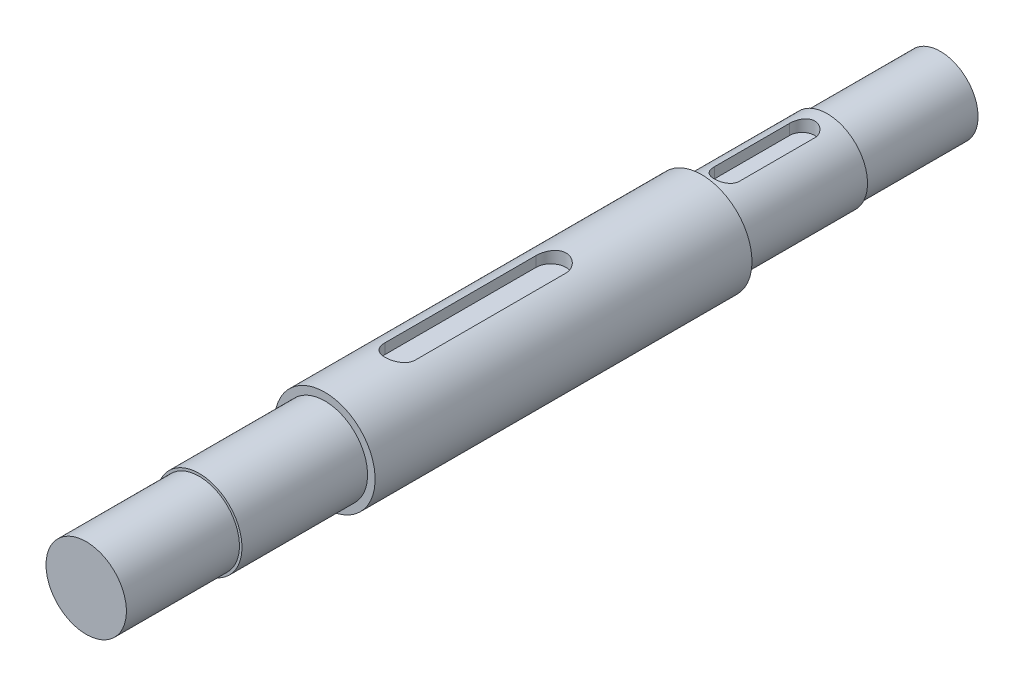
ISO-10303-21;
HEADER;
FILE_DESCRIPTION(('STEP AP214'),'2;1');
FILE_NAME('part.step','',(''),(''),'','','');
FILE_SCHEMA(('AUTOMOTIVE_DESIGN { 1 0 10303 214 1 1 1 1 }'));
ENDSEC;
DATA;
#1=APPLICATION_CONTEXT('core data for automotive mechanical design processes');
#2=APPLICATION_PROTOCOL_DEFINITION('international standard','automotive_design',2000,#1);
#3=PRODUCT_CONTEXT('',#1,'mechanical');
#4=PRODUCT('Part','Part','',(#3));
#5=PRODUCT_RELATED_PRODUCT_CATEGORY('part','',(#4));
#6=PRODUCT_DEFINITION_FORMATION('','',#4);
#7=PRODUCT_DEFINITION_CONTEXT('part definition',#1,'design');
#8=PRODUCT_DEFINITION('design','',#6,#7);
#9=PRODUCT_DEFINITION_SHAPE('','',#8);
#10=(LENGTH_UNIT() NAMED_UNIT(*) SI_UNIT(.MILLI.,.METRE.));
#11=(NAMED_UNIT(*) PLANE_ANGLE_UNIT() SI_UNIT($,.RADIAN.));
#12=(NAMED_UNIT(*) SI_UNIT($,.STERADIAN.) SOLID_ANGLE_UNIT());
#13=UNCERTAINTY_MEASURE_WITH_UNIT(LENGTH_MEASURE(1.E-05),#10,'distance_accuracy_value','');
#14=(GEOMETRIC_REPRESENTATION_CONTEXT(3) GLOBAL_UNCERTAINTY_ASSIGNED_CONTEXT((#13)) GLOBAL_UNIT_ASSIGNED_CONTEXT((#10,
#11,#12)) REPRESENTATION_CONTEXT('',''));
#15=CARTESIAN_POINT('',(0.,0.,0.));
#16=DIRECTION('',(0.,0.,1.));
#17=DIRECTION('',(1.,0.,0.));
#18=AXIS2_PLACEMENT_3D('',#15,#16,#17);
#19=CARTESIAN_POINT('',(0.,0.,0.));
#20=DIRECTION('',(0.,0.,-1.));
#21=DIRECTION('',(-1.,0.,0.));
#22=AXIS2_PLACEMENT_3D('',#19,#20,#21);
#23=CYLINDRICAL_SURFACE('',#22,20.);
#24=CARTESIAN_POINT('',(0.,0.,95.));
#25=DIRECTION('',(0.,0.,-1.));
#26=DIRECTION('',(-1.,0.,0.));
#27=AXIS2_PLACEMENT_3D('',#24,#25,#26);
#28=CIRCLE('',#27,20.);
#29=CARTESIAN_POINT('',(-20.,0.,95.));
#30=VERTEX_POINT('',#29);
#31=EDGE_CURVE('E184',#30,#30,#28,.T.);
#32=ORIENTED_EDGE('',*,*,#31,.F.);
#33=EDGE_LOOP('',(#32));
#34=FACE_BOUND('',#33,.T.);
#35=CARTESIAN_POINT('',(0.,0.,245.));
#36=DIRECTION('',(0.,0.,-1.));
#37=DIRECTION('',(-1.,0.,0.));
#38=AXIS2_PLACEMENT_3D('',#35,#36,#37);
#39=CIRCLE('',#38,20.);
#40=CARTESIAN_POINT('',(-20.,0.,245.));
#41=VERTEX_POINT('',#40);
#42=EDGE_CURVE('E188',#41,#41,#39,.T.);
#43=ORIENTED_EDGE('',*,*,#42,.T.);
#44=EDGE_LOOP('',(#43));
#45=FACE_BOUND('',#44,.T.);
#46=CARTESIAN_POINT('',(6.00000000000017,19.0787840283389,155.));
#47=CARTESIAN_POINT('',(6.00002230630971,19.0787603919218,154.835332005089));
#48=CARTESIAN_POINT('',(5.99322212828878,19.0809150948053,154.67067261307));
#49=CARTESIAN_POINT('',(5.96614198358455,19.089408588524,154.342610571615));
#50=CARTESIAN_POINT('',(5.94586504749999,19.0957464386677,154.179207647986));
#51=CARTESIAN_POINT('',(5.89206455668675,19.1124126760414,153.855233206316));
#52=CARTESIAN_POINT('',(5.85857463708954,19.1227309292375,153.694655572036));
#53=CARTESIAN_POINT('',(5.77865096251394,19.1470349488515,153.377037691332));
#54=CARTESIAN_POINT('',(5.73221686903448,19.16102081118,153.219997537531));
#55=CARTESIAN_POINT('',(5.62682620459501,19.1922338155173,152.910617439276));
#56=CARTESIAN_POINT('',(5.5678770245257,19.2094590438082,152.758274781224));
#57=CARTESIAN_POINT('',(5.43788252899642,19.2466621419291,152.459125857098));
#58=CARTESIAN_POINT('',(5.36683271334074,19.2666410353108,152.312321675672));
#59=CARTESIAN_POINT('',(5.21317247195212,19.3087849542851,152.025215054747));
#60=CARTESIAN_POINT('',(5.1305613960985,19.3309501027959,151.88491298147));
#61=CARTESIAN_POINT('',(4.95431913401991,19.3768680311909,151.611612201325));
#62=CARTESIAN_POINT('',(4.86068378223789,19.4006214097184,151.478616283128));
#63=CARTESIAN_POINT('',(4.66024014290241,19.4497584548899,151.21713642677));
#64=CARTESIAN_POINT('',(4.55313526362707,19.4751691904068,151.088884847802));
#65=CARTESIAN_POINT('',(4.32860344600283,19.5263015189751,150.841746062991));
#66=CARTESIAN_POINT('',(4.21117292654735,19.5520232171847,150.722862133329));
#67=CARTESIAN_POINT('',(3.96676059198608,19.6030710031715,150.495258604878));
#68=CARTESIAN_POINT('',(3.83977871873954,19.6283970885393,150.386539067971));
#69=CARTESIAN_POINT('',(3.57705696576226,19.6779706962222,150.179980745528));
#70=CARTESIAN_POINT('',(3.44131715512985,19.7022182270443,150.082141874161));
#71=CARTESIAN_POINT('',(3.15899953964094,19.7494715734221,149.89609023174));
#72=CARTESIAN_POINT('',(3.01225429870671,19.7724407517412,149.808121953698));
#73=CARTESIAN_POINT('',(2.71155717798069,19.8159158974823,149.644936205945));
#74=CARTESIAN_POINT('',(2.55760798995113,19.8364227748921,149.569714021433));
#75=CARTESIAN_POINT('',(2.24348996032498,19.8744001644265,149.432583560629));
#76=CARTESIAN_POINT('',(2.08331997555635,19.8918701152059,149.370677745232));
#77=CARTESIAN_POINT('',(1.75801430484789,19.923254535561,149.260762497544));
#78=CARTESIAN_POINT('',(1.59288079897405,19.9371705413066,149.212747060032));
#79=CARTESIAN_POINT('',(1.26354510595591,19.960709769643,149.132174453272));
#80=CARTESIAN_POINT('',(1.09944808925095,19.9704430293701,149.099219373042));
#81=CARTESIAN_POINT('',(0.768952154149116,19.9858966495547,149.047128002714));
#82=CARTESIAN_POINT('',(0.602554181799461,19.9916186120195,149.027986195865));
#83=CARTESIAN_POINT('',(0.268644299740396,19.9988929276978,149.003680035143));
#84=CARTESIAN_POINT('',(0.101132356361144,20.0004451543013,148.998516105694));
#85=CARTESIAN_POINT('',(-0.23372090041069,19.9993350985709,149.002216405078));
#86=CARTESIAN_POINT('',(-0.401062216878332,19.9966728935832,149.011080376463));
#87=CARTESIAN_POINT('',(-0.728949940400138,19.9873626800315,149.042242211602));
#88=CARTESIAN_POINT('',(-0.889542117296485,19.9808452710305,149.064100009983));
#89=CARTESIAN_POINT('',(-1.20830021014889,19.9641050678088,149.120695481758));
#90=CARTESIAN_POINT('',(-1.36646528055398,19.9538810115069,149.155437542225));
#91=CARTESIAN_POINT('',(-1.67917461818921,19.9300014175933,149.23749230161));
#92=CARTESIAN_POINT('',(-1.83372008335715,19.916347033335,149.284800775723));
#93=CARTESIAN_POINT('',(-2.13828018933718,19.8859545815151,149.391630271063));
#94=CARTESIAN_POINT('',(-2.28829310223854,19.8692153547843,149.451155883997));
#95=CARTESIAN_POINT('',(-2.58443507880925,19.8328818557961,149.582690579539));
#96=CARTESIAN_POINT('',(-2.73050124822103,19.8132575095083,149.654832897198));
#97=CARTESIAN_POINT('',(-3.01609632375403,19.7717979578185,149.810623147329));
#98=CARTESIAN_POINT('',(-3.15562296424223,19.7499619943592,149.894275028384));
#99=CARTESIAN_POINT('',(-3.42724384686874,19.704643118031,150.072486982441));
#100=CARTESIAN_POINT('',(-3.55933800314009,19.681160186142,150.167047181428));
#101=CARTESIAN_POINT('',(-3.81531376455338,19.6331439703208,150.366458678429));
#102=CARTESIAN_POINT('',(-3.93919513006467,19.6086106557752,150.471310276501));
#103=CARTESIAN_POINT('',(-4.18263653591635,19.5581593507452,150.694897243463));
#104=CARTESIAN_POINT('',(-4.30184428600917,19.5322244988475,150.814012679474));
#105=CARTESIAN_POINT('',(-4.52981041510251,19.4806179410543,151.061833503502));
#106=CARTESIAN_POINT('',(-4.63857214120799,19.4549461532391,151.190535796081));
#107=CARTESIAN_POINT('',(-4.84504126060948,19.4045581786368,151.456840396238));
#108=CARTESIAN_POINT('',(-4.94274124635215,19.3798426394128,151.594448571901));
#109=CARTESIAN_POINT('',(-5.12628631686307,19.3321023379675,151.877559092333));
#110=CARTESIAN_POINT('',(-5.21213600998861,19.3090769201298,152.023058337578));
#111=CARTESIAN_POINT('',(-5.3722308036755,19.2651525602886,152.322635135093));
#112=CARTESIAN_POINT('',(-5.44634371437385,19.2442786555292,152.476787078659));
#113=CARTESIAN_POINT('',(-5.58122691640486,19.205593723789,152.791121841361));
#114=CARTESIAN_POINT('',(-5.64200266456187,19.1877814448102,152.951302162478));
#115=CARTESIAN_POINT('',(-5.74966145349615,19.1557967477957,153.27643211835));
#116=CARTESIAN_POINT('',(-5.7965591282547,19.1416204978024,153.441376526563));
#117=CARTESIAN_POINT('',(-5.87609462586421,19.1173543231183,153.774893180451));
#118=CARTESIAN_POINT('',(-5.9087390260436,19.1072625137755,153.943463715048));
#119=CARTESIAN_POINT('',(-5.95603131732384,19.0925703406669,154.259937070236));
#120=CARTESIAN_POINT('',(-5.97251971262409,19.0874107715083,154.40754170936));
#121=CARTESIAN_POINT('',(-5.99450261914139,19.0805126306353,154.703427112475));
#122=CARTESIAN_POINT('',(-6.00001329545491,19.0787690288454,154.851706559575));
#123=CARTESIAN_POINT('',(-5.99999999999983,19.078784028339,155.));
#124=B_SPLINE_CURVE_WITH_KNOTS('',3,(#46,#47,#48,#49,#50,#51,#52,#53,#54,#55,#56,#57,#58,#59,
#60,#61,#62,#63,#64,#65,#66,#67,#68,#69,#70,#71,#72,#73,#74,#75,#76,#77,#78,#79,#80,#81,#82,#83,
#84,#85,#86,#87,#88,#89,#90,#91,#92,#93,#94,#95,#96,#97,#98,#99,#100,#101,#102,#103,#104,#105,
#106,#107,#108,#109,#110,#111,#112,#113,#114,#115,#116,#117,#118,#119,#120,#121,#122,#123),
.UNSPECIFIED.,.F.,.F.,(4,2,2,2,2,2,2,2,2,2,2,2,2,2,2,2,2,2,2,2,2,2,2,2,2,2,2,2,2,2,2,2,2,2,2,2,
2,2,4),(0.,0.493836284878976,0.987561555412216,1.48003801924605,1.97252736296405,
2.46472666795178,2.95710942192586,3.44951987503682,3.94211698773,4.44857898474592,
4.95521732942468,5.46185875834847,5.96849619046396,6.48574341264193,7.00279888450885,
7.51994982748061,8.03687685551445,8.53921958328379,9.04136157401789,9.5435188116382,
10.0456668334346,10.531706521874,11.0179118582603,11.5039539397552,11.9901790315928,
12.4818885441265,12.9737671698834,13.4656514771114,13.9575501300996,14.4684682486943,
14.9792221093922,15.4903160010787,16.001210574562,16.5175029344931,17.0335836608614,
17.549118241575,18.0644146711719,18.509813123396,18.9545552237083),.UNSPECIFIED.);
#125=CARTESIAN_POINT('',(6.00000000000017,19.0787840283389,155.));
#126=VERTEX_POINT('',#125);
#127=CARTESIAN_POINT('',(-5.99999999999983,19.078784028339,155.));
#128=VERTEX_POINT('',#127);
#129=EDGE_CURVE('E251',#126,#128,#124,.T.);
#130=ORIENTED_EDGE('',*,*,#129,.F.);
#131=DIRECTION('',(0.,0.,-1.));
#132=VECTOR('',#131,1.);
#133=CARTESIAN_POINT('',(6.00000000000017,19.0787840283389,0.));
#134=LINE('',#133,#132);
#135=CARTESIAN_POINT('',(6.00000000000017,19.0787840283389,215.));
#136=VERTEX_POINT('',#135);
#137=EDGE_CURVE('E11',#136,#126,#134,.T.);
#138=ORIENTED_EDGE('',*,*,#137,.F.);
#139=CARTESIAN_POINT('',(-5.99999999999983,19.078784028339,215.));
#140=CARTESIAN_POINT('',(-6.00002230630936,19.0787603919219,215.164667994911));
#141=CARTESIAN_POINT('',(-5.99322212828844,19.0809150948054,215.32932738693));
#142=CARTESIAN_POINT('',(-5.96614198358421,19.0894085885241,215.657389428385));
#143=CARTESIAN_POINT('',(-5.94586504749965,19.0957464386678,215.820792352014));
#144=CARTESIAN_POINT('',(-5.89206455668642,19.1124126760415,216.144766793684));
#145=CARTESIAN_POINT('',(-5.8585746370892,19.1227309292376,216.305344427964));
#146=CARTESIAN_POINT('',(-5.7786509625136,19.1470349488516,216.622962308668));
#147=CARTESIAN_POINT('',(-5.73221686903414,19.1610208111801,216.780002462469));
#148=CARTESIAN_POINT('',(-5.62682620459467,19.1922338155173,217.089382560724));
#149=CARTESIAN_POINT('',(-5.56787702452536,19.2094590438083,217.241725218776));
#150=CARTESIAN_POINT('',(-5.43788252899608,19.2466621419291,217.540874142902));
#151=CARTESIAN_POINT('',(-5.36683271334041,19.2666410353109,217.687678324328));
#152=CARTESIAN_POINT('',(-5.21317247195179,19.3087849542852,217.974784945253));
#153=CARTESIAN_POINT('',(-5.13056139609817,19.330950102796,218.11508701853));
#154=CARTESIAN_POINT('',(-4.95431913401957,19.3768680311909,218.388387798675));
#155=CARTESIAN_POINT('',(-4.86068378223755,19.4006214097185,218.521383716872));
#156=CARTESIAN_POINT('',(-4.66024014290207,19.44975845489,218.78286357323));
#157=CARTESIAN_POINT('',(-4.55313526362673,19.4751691904069,218.911115152198));
#158=CARTESIAN_POINT('',(-4.32860344600248,19.5263015189752,219.158253937009));
#159=CARTESIAN_POINT('',(-4.21117292654701,19.5520232171848,219.277137866671));
#160=CARTESIAN_POINT('',(-3.96676059198573,19.6030710031715,219.504741395122));
#161=CARTESIAN_POINT('',(-3.83977871873919,19.6283970885394,219.613460932029));
#162=CARTESIAN_POINT('',(-3.57705696576191,19.6779706962223,219.820019254472));
#163=CARTESIAN_POINT('',(-3.44131715512949,19.7022182270444,219.917858125839));
#164=CARTESIAN_POINT('',(-3.15899953964057,19.7494715734221,220.10390976826));
#165=CARTESIAN_POINT('',(-3.01225429870634,19.7724407517413,220.191878046302));
#166=CARTESIAN_POINT('',(-2.71155717798033,19.8159158974823,220.355063794055));
#167=CARTESIAN_POINT('',(-2.55760798995078,19.8364227748921,220.430285978567));
#168=CARTESIAN_POINT('',(-2.24348996032463,19.8744001644266,220.567416439371));
#169=CARTESIAN_POINT('',(-2.083319975556,19.8918701152059,220.629322254768));
#170=CARTESIAN_POINT('',(-1.75801430484754,19.9232545355611,220.739237502456));
#171=CARTESIAN_POINT('',(-1.59288079897371,19.9371705413066,220.787252939968));
#172=CARTESIAN_POINT('',(-1.26354510595557,19.960709769643,220.867825546728));
#173=CARTESIAN_POINT('',(-1.09944808925061,19.9704430293702,220.900780626958));
#174=CARTESIAN_POINT('',(-0.76895215414877,19.9858966495547,220.952871997286));
#175=CARTESIAN_POINT('',(-0.602554181799117,19.9916186120196,220.972013804135));
#176=CARTESIAN_POINT('',(-0.268644299740054,19.9988929276978,220.996319964857));
#177=CARTESIAN_POINT('',(-0.1011323563608,20.0004451543013,221.001483894306));
#178=CARTESIAN_POINT('',(0.233720900411035,19.9993350985709,220.997783594922));
#179=CARTESIAN_POINT('',(0.401062216878677,19.9966728935831,220.988919623537));
#180=CARTESIAN_POINT('',(0.72894994040048,19.9873626800315,220.957757788398));
#181=CARTESIAN_POINT('',(0.889542117296824,19.9808452710305,220.935899990017));
#182=CARTESIAN_POINT('',(1.20830021014923,19.9641050678088,220.879304518242));
#183=CARTESIAN_POINT('',(1.36646528055431,19.9538810115069,220.844562457775));
#184=CARTESIAN_POINT('',(1.67917461818955,19.9300014175933,220.76250769839));
#185=CARTESIAN_POINT('',(1.83372008335749,19.916347033335,220.715199224277));
#186=CARTESIAN_POINT('',(2.13828018933751,19.885954581515,220.608369728937));
#187=CARTESIAN_POINT('',(2.28829310223887,19.8692153547843,220.548844116003));
#188=CARTESIAN_POINT('',(2.58443507880958,19.8328818557961,220.417309420461));
#189=CARTESIAN_POINT('',(2.73050124822137,19.8132575095082,220.345167102802));
#190=CARTESIAN_POINT('',(3.01609632375437,19.7717979578185,220.189376852671));
#191=CARTESIAN_POINT('',(3.15562296424257,19.7499619943591,220.105724971616));
#192=CARTESIAN_POINT('',(3.42724384686907,19.704643118031,219.927513017559));
#193=CARTESIAN_POINT('',(3.55933800314043,19.6811601861419,219.832952818572));
#194=CARTESIAN_POINT('',(3.81531376455373,19.6331439703208,219.633541321571));
#195=CARTESIAN_POINT('',(3.93919513006501,19.6086106557752,219.528689723499));
#196=CARTESIAN_POINT('',(4.18263653591669,19.5581593507451,219.305102756537));
#197=CARTESIAN_POINT('',(4.30184428600951,19.5322244988474,219.185987320526));
#198=CARTESIAN_POINT('',(4.52981041510285,19.4806179410542,218.938166496498));
#199=CARTESIAN_POINT('',(4.63857214120832,19.454946153239,218.809464203919));
#200=CARTESIAN_POINT('',(4.84504126060982,19.4045581786367,218.543159603762));
#201=CARTESIAN_POINT('',(4.94274124635249,19.3798426394128,218.405551428099));
#202=CARTESIAN_POINT('',(5.12628631686341,19.3321023379674,218.122440907667));
#203=CARTESIAN_POINT('',(5.21213600998894,19.3090769201297,217.976941662422));
#204=CARTESIAN_POINT('',(5.37223080367583,19.2651525602885,217.677364864907));
#205=CARTESIAN_POINT('',(5.44634371437418,19.2442786555291,217.523212921341));
#206=CARTESIAN_POINT('',(5.58122691640519,19.2055937237889,217.208878158639));
#207=CARTESIAN_POINT('',(5.6420026645622,19.1877814448102,217.048697837522));
#208=CARTESIAN_POINT('',(5.74966145349648,19.1557967477956,216.72356788165));
#209=CARTESIAN_POINT('',(5.79655912825504,19.1416204978023,216.558623473437));
#210=CARTESIAN_POINT('',(5.87609462586455,19.1173543231182,216.225106819549));
#211=CARTESIAN_POINT('',(5.90873902604394,19.1072625137754,216.056536284952));
#212=CARTESIAN_POINT('',(5.95603131732418,19.0925703406668,215.740062929764));
#213=CARTESIAN_POINT('',(5.97251971262442,19.0874107715082,215.59245829064));
#214=CARTESIAN_POINT('',(5.99450261914172,19.0805126306352,215.296572887525));
#215=CARTESIAN_POINT('',(6.00001329545525,19.0787690288453,215.148293440425));
#216=CARTESIAN_POINT('',(6.00000000000017,19.0787840283389,215.));
#217=B_SPLINE_CURVE_WITH_KNOTS('',3,(#139,#140,#141,#142,#143,#144,#145,#146,#147,#148,#149,
#150,#151,#152,#153,#154,#155,#156,#157,#158,#159,#160,#161,#162,#163,#164,#165,#166,#167,#168,
#169,#170,#171,#172,#173,#174,#175,#176,#177,#178,#179,#180,#181,#182,#183,#184,#185,#186,#187,
#188,#189,#190,#191,#192,#193,#194,#195,#196,#197,#198,#199,#200,#201,#202,#203,#204,#205,#206,
#207,#208,#209,#210,#211,#212,#213,#214,#215,#216),.UNSPECIFIED.,.F.,.F.,(4,2,2,2,2,2,2,2,2,2,2,
2,2,2,2,2,2,2,2,2,2,2,2,2,2,2,2,2,2,2,2,2,2,2,2,2,2,2,4),(0.,0.493836284878976,
0.987561555412215,1.48003801924605,1.97252736296405,2.46472666795178,2.95710942192586,
3.44951987503682,3.94211698772999,4.44857898474592,4.95521732942468,5.46185875834849,
5.96849619046399,6.48574341264197,7.00279888450886,7.51994982748061,8.03687685551445,
8.5392195832838,9.0413615740179,9.54351881163821,10.0456668334346,10.531706521874,
11.0179118582603,11.5039539397551,11.9901790315928,12.4818885441265,12.9737671698834,
13.4656514771114,13.9575501300996,14.4684682486943,14.9792221093922,15.4903160010787,
16.001210574562,16.517502934493,17.0335836608614,17.5491182415751,18.0644146711719,
18.509813123396,18.9545552237083),.UNSPECIFIED.);
#218=CARTESIAN_POINT('',(-5.99999999999983,19.078784028339,215.));
#219=VERTEX_POINT('',#218);
#220=EDGE_CURVE('E52',#219,#136,#217,.T.);
#221=ORIENTED_EDGE('',*,*,#220,.F.);
#222=DIRECTION('',(0.,0.,-1.));
#223=VECTOR('',#222,1.);
#224=CARTESIAN_POINT('',(-5.99999999999983,19.078784028339,0.));
#225=LINE('',#224,#223);
#226=EDGE_CURVE('E131',#128,#219,#225,.F.);
#227=ORIENTED_EDGE('',*,*,#226,.F.);
#228=EDGE_LOOP('',(#130,#138,#221,#227));
#229=FACE_BOUND('',#228,.T.);
#230=ADVANCED_FACE('F43',(#34,#45,#229),#23,.T.);
#231=CARTESIAN_POINT('',(0.,0.,0.));
#232=DIRECTION('',(0.,0.,-1.));
#233=DIRECTION('',(-1.,0.,0.));
#234=AXIS2_PLACEMENT_3D('',#231,#232,#233);
#235=CYLINDRICAL_SURFACE('',#234,16.);
#236=CARTESIAN_POINT('',(0.,0.,45.));
#237=DIRECTION('',(0.,0.,-1.));
#238=DIRECTION('',(-1.,0.,0.));
#239=AXIS2_PLACEMENT_3D('',#236,#237,#238);
#240=CIRCLE('',#239,16.);
#241=CARTESIAN_POINT('',(-16.,0.,45.));
#242=VERTEX_POINT('',#241);
#243=EDGE_CURVE('E176',#242,#242,#240,.T.);
#244=ORIENTED_EDGE('',*,*,#243,.F.);
#245=EDGE_LOOP('',(#244));
#246=FACE_BOUND('',#245,.T.);
#247=CARTESIAN_POINT('',(0.,0.,95.));
#248=DIRECTION('',(0.,0.,-1.));
#249=DIRECTION('',(-1.,0.,0.));
#250=AXIS2_PLACEMENT_3D('',#247,#248,#249);
#251=CIRCLE('',#250,16.);
#252=CARTESIAN_POINT('',(-16.,0.,95.));
#253=VERTEX_POINT('',#252);
#254=EDGE_CURVE('E180',#253,#253,#251,.T.);
#255=ORIENTED_EDGE('',*,*,#254,.T.);
#256=EDGE_LOOP('',(#255));
#257=FACE_BOUND('',#256,.T.);
#258=CARTESIAN_POINT('',(-4.99999999999999,15.1986841535707,85.));
#259=CARTESIAN_POINT('',(-5.00001876402017,15.1986635060155,85.1369297177379));
#260=CARTESIAN_POINT('',(-4.99437589347759,15.2005339376472,85.2738515786107));
#261=CARTESIAN_POINT('',(-4.9719066012981,15.2079058985265,85.5466441616811));
#262=CARTESIAN_POINT('',(-4.95508287500205,15.2134065526432,85.682515129231));
#263=CARTESIAN_POINT('',(-4.91045141983463,15.2278686056186,85.9518756253299));
#264=CARTESIAN_POINT('',(-4.88267328245064,15.2368206796073,86.0853705652593));
#265=CARTESIAN_POINT('',(-4.81639022533697,15.2579029145887,86.3494121913658));
#266=CARTESIAN_POINT('',(-4.77788498675235,15.2700331700498,86.479958789781));
#267=CARTESIAN_POINT('',(-4.6904983772981,15.2971014107057,86.7371387356005));
#268=CARTESIAN_POINT('',(-4.64162394412444,15.3120375178334,86.8637746349516));
#269=CARTESIAN_POINT('',(-4.53387888598119,15.3442856115609,87.1124230254503));
#270=CARTESIAN_POINT('',(-4.47500453795588,15.3615984825888,87.2344337738435));
#271=CARTESIAN_POINT('',(-4.28398711580931,15.4163884767029,87.5923890679799));
#272=CARTESIAN_POINT('',(-4.13740351463561,15.4567319869187,87.8203916857904));
#273=CARTESIAN_POINT('',(-3.80477014396878,15.5420083062615,88.2559520827829));
#274=CARTESIAN_POINT('',(-3.61763914961477,15.5870445200358,88.4626585082762));
#275=CARTESIAN_POINT('',(-3.21145982301366,15.6757673694125,88.8423676526894));
#276=CARTESIAN_POINT('',(-2.99240601054463,15.7194537717275,89.0153645727234));
#277=CARTESIAN_POINT('',(-2.52249761762138,15.8017432610087,89.3264503978222));
#278=CARTESIAN_POINT('',(-2.27103576512447,15.8402090039263,89.4636611267965));
#279=CARTESIAN_POINT('',(-1.74720631304674,15.9065031203034,89.6935071381779));
#280=CARTESIAN_POINT('',(-1.47484448775401,15.9343344192537,89.7861546815474));
#281=CARTESIAN_POINT('',(-0.925860089211036,15.9754868433124,89.921404023007));
#282=CARTESIAN_POINT('',(-0.649628435012763,15.989229278753,89.9654621090382));
#283=CARTESIAN_POINT('',(-0.0933690149137086,16.0021438524195,90.0068974314688));
#284=CARTESIAN_POINT('',(0.186657953048535,16.0013190072522,90.0042843325814));
#285=CARTESIAN_POINT('',(0.73229958954639,15.9854845726588,89.9534065239998));
#286=CARTESIAN_POINT('',(0.998078033880914,15.9709657627342,89.9067212697878));
#287=CARTESIAN_POINT('',(1.51781473163232,15.9299791073477,89.7716196828297));
#288=CARTESIAN_POINT('',(1.77177234876053,15.90351061948,89.6832011065194));
#289=CARTESIAN_POINT('',(2.26431537219272,15.8409378140145,89.4661161738423));
#290=CARTESIAN_POINT('',(2.50267435181536,15.8047194262738,89.3369700371082));
#291=CARTESIAN_POINT('',(2.95480608942299,15.7264700104951,89.0425232216915));
#292=CARTESIAN_POINT('',(3.16857286940456,15.6844375745929,88.8772137804566));
#293=CARTESIAN_POINT('',(3.57495597883695,15.5969449434458,88.5068863322796));
#294=CARTESIAN_POINT('',(3.76632311133059,15.5514148920094,88.3005029256288));
#295=CARTESIAN_POINT('',(4.02553989626261,15.4855747041344,87.9689743734189));
#296=CARTESIAN_POINT('',(4.10735324144972,15.464023127535,87.8547196773283));
#297=CARTESIAN_POINT('',(4.2611738972957,15.4223452821405,87.6195614218215));
#298=CARTESIAN_POINT('',(4.33318503733556,15.4022184582275,87.4986604849243));
#299=CARTESIAN_POINT('',(4.4676837074109,15.3637482945825,87.2494667746369));
#300=CARTESIAN_POINT('',(4.53004475183007,15.3454296242414,87.1211019815447));
#301=CARTESIAN_POINT('',(4.64365087484839,15.3114343470153,86.8592633981691));
#302=CARTESIAN_POINT('',(4.69490052987993,15.2957566529907,86.7257917379939));
#303=CARTESIAN_POINT('',(4.78581076137362,15.2675565411669,86.4547920818445));
#304=CARTESIAN_POINT('',(4.82548366541209,15.2550307689955,86.3172685736427));
#305=CARTESIAN_POINT('',(4.89292357731496,15.2335336556112,86.039118633416));
#306=CARTESIAN_POINT('',(4.92069605575215,15.2245606813372,85.8984936584496));
#307=CARTESIAN_POINT('',(4.96155201839677,15.2112927618778,85.6316869336986));
#308=CARTESIAN_POINT('',(4.97596872830392,15.2065749583153,85.5057286808262));
#309=CARTESIAN_POINT('',(4.9951923004764,15.2002655216957,85.2531834848566));
#310=CARTESIAN_POINT('',(5.00001273345968,15.1986694740171,85.1265976837225));
#311=CARTESIAN_POINT('',(5.00000000000001,15.1986841535707,85.));
#312=B_SPLINE_CURVE_WITH_KNOTS('',3,(#258,#259,#260,#261,#262,#263,#264,#265,#266,#267,#268,
#269,#270,#271,#272,#273,#274,#275,#276,#277,#278,#279,#280,#281,#282,#283,#284,#285,#286,#287,
#288,#289,#290,#291,#292,#293,#294,#295,#296,#297,#298,#299,#300,#301,#302,#303,#304,#305,#306,
#307,#308,#309,#310,#311),.UNSPECIFIED.,.F.,.F.,(4,2,2,2,2,2,2,2,2,2,2,2,2,2,2,2,2,2,2,2,2,2,2,
2,2,2,4),(0.,0.410647919758036,0.821196881542661,1.2306443292275,1.64010394872541,
2.04929047101912,2.45862967230993,3.2768827913103,4.12046514534441,4.96419248897059,
5.827005743272,6.68958147010311,7.52553600517323,8.36131743199139,9.16823951381226,
9.97520498033131,10.7920560572179,11.609105280929,12.4601312020614,12.8862315051731,
13.3121648650028,13.7432787284905,14.1742146909751,14.604690079864,15.0349673682784,
15.4151752920152,15.7948451560185),.UNSPECIFIED.);
#313=CARTESIAN_POINT('',(-4.99999999999999,15.1986841535707,85.));
#314=VERTEX_POINT('',#313);
#315=CARTESIAN_POINT('',(5.00000000000001,15.1986841535707,85.));
#316=VERTEX_POINT('',#315);
#317=EDGE_CURVE('E208',#314,#316,#312,.T.);
#318=ORIENTED_EDGE('',*,*,#317,.F.);
#319=DIRECTION('',(0.,0.,-1.));
#320=VECTOR('',#319,1.);
#321=CARTESIAN_POINT('',(-4.99999999999999,15.1986841535707,0.));
#322=LINE('',#321,#320);
#323=CARTESIAN_POINT('',(-4.99999999999999,15.1986841535707,55.));
#324=VERTEX_POINT('',#323);
#325=EDGE_CURVE('E248',#324,#314,#322,.F.);
#326=ORIENTED_EDGE('',*,*,#325,.F.);
#327=CARTESIAN_POINT('',(5.00000000000001,15.1986841535707,55.));
#328=CARTESIAN_POINT('',(5.00001876402019,15.1986635060155,54.8630702822621));
#329=CARTESIAN_POINT('',(4.9943758934776,15.2005339376472,54.7261484213893));
#330=CARTESIAN_POINT('',(4.97190660129811,15.2079058985265,54.4533558383188));
#331=CARTESIAN_POINT('',(4.95508287500207,15.2134065526432,54.3174848707689));
#332=CARTESIAN_POINT('',(4.91045141983464,15.2278686056186,54.0481243746701));
#333=CARTESIAN_POINT('',(4.88267328245065,15.2368206796073,53.9146294347407));
#334=CARTESIAN_POINT('',(4.81639022533698,15.2579029145887,53.6505878086342));
#335=CARTESIAN_POINT('',(4.77788498675236,15.2700331700498,53.520041210219));
#336=CARTESIAN_POINT('',(4.69049837729812,15.2971014107057,53.2628612643995));
#337=CARTESIAN_POINT('',(4.64162394412446,15.3120375178334,53.1362253650484));
#338=CARTESIAN_POINT('',(4.53387888598121,15.3442856115609,52.8875769745497));
#339=CARTESIAN_POINT('',(4.4750045379559,15.3615984825888,52.7655662261564));
#340=CARTESIAN_POINT('',(4.28398711580933,15.4163884767029,52.4076109320201));
#341=CARTESIAN_POINT('',(4.13740351463562,15.4567319869187,52.1796083142096));
#342=CARTESIAN_POINT('',(3.80477014396879,15.5420083062615,51.7440479172171));
#343=CARTESIAN_POINT('',(3.61763914961479,15.5870445200358,51.5373414917237));
#344=CARTESIAN_POINT('',(3.21145982301369,15.6757673694125,51.1576323473105));
#345=CARTESIAN_POINT('',(2.99240601054465,15.7194537717275,50.9846354272766));
#346=CARTESIAN_POINT('',(2.5224976176214,15.8017432610087,50.6735496021778));
#347=CARTESIAN_POINT('',(2.2710357651245,15.8402090039263,50.5363388732035));
#348=CARTESIAN_POINT('',(1.74720631304677,15.9065031203034,50.3064928618221));
#349=CARTESIAN_POINT('',(1.47484448775404,15.9343344192537,50.2138453184526));
#350=CARTESIAN_POINT('',(0.925860089211065,15.9754868433124,50.078595976993));
#351=CARTESIAN_POINT('',(0.64962843501279,15.989229278753,50.0345378909617));
#352=CARTESIAN_POINT('',(0.0933690149137325,16.0021438524195,49.9931025685312));
#353=CARTESIAN_POINT('',(-0.186657953048512,16.0013190072522,49.9957156674186));
#354=CARTESIAN_POINT('',(-0.732299589546367,15.9854845726588,50.0465934760002));
#355=CARTESIAN_POINT('',(-0.998078033880891,15.9709657627342,50.0932787302122));
#356=CARTESIAN_POINT('',(-1.5178147316323,15.9299791073477,50.2283803171703));
#357=CARTESIAN_POINT('',(-1.77177234876051,15.90351061948,50.3167988934806));
#358=CARTESIAN_POINT('',(-2.2643153721927,15.8409378140145,50.5338838261577));
#359=CARTESIAN_POINT('',(-2.50267435181535,15.8047194262738,50.6630299628918));
#360=CARTESIAN_POINT('',(-2.95480608942298,15.7264700104951,50.9574767783085));
#361=CARTESIAN_POINT('',(-3.16857286940455,15.6844375745929,51.1227862195434));
#362=CARTESIAN_POINT('',(-3.57495597883694,15.5969449434458,51.4931136677204));
#363=CARTESIAN_POINT('',(-3.76632311133058,15.5514148920094,51.6994970743711));
#364=CARTESIAN_POINT('',(-4.0255398962626,15.4855747041344,52.0310256265811));
#365=CARTESIAN_POINT('',(-4.10735324144971,15.464023127535,52.1452803226716));
#366=CARTESIAN_POINT('',(-4.26117389729569,15.4223452821405,52.3804385781784));
#367=CARTESIAN_POINT('',(-4.33318503733555,15.4022184582275,52.5013395150756));
#368=CARTESIAN_POINT('',(-4.46768370741089,15.3637482945824,52.750533225363));
#369=CARTESIAN_POINT('',(-4.53004475183006,15.3454296242414,52.8788980184553));
#370=CARTESIAN_POINT('',(-4.64365087484838,15.3114343470153,53.1407366018309));
#371=CARTESIAN_POINT('',(-4.69490052987992,15.2957566529907,53.2742082620061));
#372=CARTESIAN_POINT('',(-4.78581076137361,15.2675565411669,53.5452079181555));
#373=CARTESIAN_POINT('',(-4.82548366541208,15.2550307689955,53.6827314263573));
#374=CARTESIAN_POINT('',(-4.89292357731495,15.2335336556112,53.960881366584));
#375=CARTESIAN_POINT('',(-4.92069605575213,15.2245606813372,54.1015063415504));
#376=CARTESIAN_POINT('',(-4.96155201839675,15.2112927618778,54.3683130663014));
#377=CARTESIAN_POINT('',(-4.97596872830391,15.2065749583153,54.4942713191738));
#378=CARTESIAN_POINT('',(-4.99519230047639,15.2002655216957,54.7468165151434));
#379=CARTESIAN_POINT('',(-5.00001273345967,15.1986694740171,54.8734023162774));
#380=CARTESIAN_POINT('',(-4.99999999999999,15.1986841535707,55.));
#381=B_SPLINE_CURVE_WITH_KNOTS('',3,(#327,#328,#329,#330,#331,#332,#333,#334,#335,#336,#337,
#338,#339,#340,#341,#342,#343,#344,#345,#346,#347,#348,#349,#350,#351,#352,#353,#354,#355,#356,
#357,#358,#359,#360,#361,#362,#363,#364,#365,#366,#367,#368,#369,#370,#371,#372,#373,#374,#375,
#376,#377,#378,#379,#380),.UNSPECIFIED.,.F.,.F.,(4,2,2,2,2,2,2,2,2,2,2,2,2,2,2,2,2,2,2,2,2,2,2,
2,2,2,4),(0.,0.410647919758043,0.821196881542668,1.23064432922752,1.64010394872541,
2.04929047101912,2.45862967230994,3.2768827913103,4.12046514534441,4.96419248897057,
5.82700574327198,6.68958147010309,7.52553600517321,8.36131743199138,9.16823951381225,
9.97520498033131,10.7920560572179,11.609105280929,12.4601312020614,12.8862315051731,
13.3121648650028,13.7432787284905,14.1742146909751,14.6046900798641,15.0349673682784,
15.4151752920152,15.7948451560185),.UNSPECIFIED.);
#382=CARTESIAN_POINT('',(5.00000000000001,15.1986841535707,55.));
#383=VERTEX_POINT('',#382);
#384=EDGE_CURVE('E241',#383,#324,#381,.T.);
#385=ORIENTED_EDGE('',*,*,#384,.F.);
#386=DIRECTION('',(0.,0.,-1.));
#387=VECTOR('',#386,1.);
#388=CARTESIAN_POINT('',(5.00000000000001,15.1986841535707,0.));
#389=LINE('',#388,#387);
#390=EDGE_CURVE('E217',#316,#383,#389,.T.);
#391=ORIENTED_EDGE('',*,*,#390,.F.);
#392=EDGE_LOOP('',(#318,#326,#385,#391));
#393=FACE_BOUND('',#392,.T.);
#394=ADVANCED_FACE('F219',(#246,#257,#393),#235,.T.);
#395=CARTESIAN_POINT('',(15.,0.,0.));
#396=DIRECTION('',(0.,0.,1.));
#397=DIRECTION('',(1.,0.,0.));
#398=AXIS2_PLACEMENT_3D('',#395,#396,#397);
#399=PLANE('',#398);
#400=CARTESIAN_POINT('',(0.,0.,0.));
#401=DIRECTION('',(0.,0.,-1.));
#402=DIRECTION('',(-1.,0.,0.));
#403=AXIS2_PLACEMENT_3D('',#400,#401,#402);
#404=CIRCLE('',#403,15.);
#405=CARTESIAN_POINT('',(-15.,0.,0.));
#406=VERTEX_POINT('',#405);
#407=EDGE_CURVE('E168',#406,#406,#404,.T.);
#408=ORIENTED_EDGE('',*,*,#407,.T.);
#409=EDGE_LOOP('',(#408));
#410=FACE_BOUND('',#409,.T.);
#411=ADVANCED_FACE('F45',(#410),#399,.F.);
#412=CARTESIAN_POINT('',(16.0000000000001,0.,340.));
#413=DIRECTION('',(0.,0.,-1.));
#414=DIRECTION('',(-1.,0.,0.));
#415=AXIS2_PLACEMENT_3D('',#412,#413,#414);
#416=PLANE('',#415);
#417=CARTESIAN_POINT('',(0.,0.,340.));
#418=DIRECTION('',(0.,0.,-1.));
#419=DIRECTION('',(-1.,0.,0.));
#420=AXIS2_PLACEMENT_3D('',#417,#418,#419);
#421=CIRCLE('',#420,16.);
#422=CARTESIAN_POINT('',(-16.,0.,340.));
#423=VERTEX_POINT('',#422);
#424=EDGE_CURVE('E204',#423,#423,#421,.T.);
#425=ORIENTED_EDGE('',*,*,#424,.F.);
#426=EDGE_LOOP('',(#425));
#427=FACE_BOUND('',#426,.T.);
#428=ADVANCED_FACE('F472',(#427),#416,.F.);
#429=CARTESIAN_POINT('',(0.,0.,0.));
#430=DIRECTION('',(0.,0.,-1.));
#431=DIRECTION('',(-1.,0.,0.));
#432=AXIS2_PLACEMENT_3D('',#429,#430,#431);
#433=CYLINDRICAL_SURFACE('',#432,16.);
#434=CARTESIAN_POINT('',(0.,0.,295.));
#435=DIRECTION('',(0.,0.,-1.));
#436=DIRECTION('',(-1.,0.,0.));
#437=AXIS2_PLACEMENT_3D('',#434,#435,#436);
#438=CIRCLE('',#437,16.);
#439=CARTESIAN_POINT('',(-16.,0.,295.));
#440=VERTEX_POINT('',#439);
#441=EDGE_CURVE('E200',#440,#440,#438,.T.);
#442=ORIENTED_EDGE('',*,*,#441,.F.);
#443=EDGE_LOOP('',(#442));
#444=FACE_BOUND('',#443,.T.);
#445=ORIENTED_EDGE('',*,*,#424,.T.);
#446=EDGE_LOOP('',(#445));
#447=FACE_BOUND('',#446,.T.);
#448=ADVANCED_FACE('F462',(#444,#447),#433,.T.);
#449=CARTESIAN_POINT('',(17.0000000000001,0.,295.));
#450=DIRECTION('',(0.,0.,-1.));
#451=DIRECTION('',(-1.,0.,0.));
#452=AXIS2_PLACEMENT_3D('',#449,#450,#451);
#453=PLANE('',#452);
#454=CARTESIAN_POINT('',(0.,0.,295.));
#455=DIRECTION('',(0.,0.,-1.));
#456=DIRECTION('',(-1.,0.,0.));
#457=AXIS2_PLACEMENT_3D('',#454,#455,#456);
#458=CIRCLE('',#457,17.);
#459=CARTESIAN_POINT('',(-17.,0.,295.));
#460=VERTEX_POINT('',#459);
#461=EDGE_CURVE('E196',#460,#460,#458,.T.);
#462=ORIENTED_EDGE('',*,*,#461,.F.);
#463=EDGE_LOOP('',(#462));
#464=FACE_BOUND('',#463,.T.);
#465=ORIENTED_EDGE('',*,*,#441,.T.);
#466=EDGE_LOOP('',(#465));
#467=FACE_BOUND('',#466,.T.);
#468=ADVANCED_FACE('F452',(#464,#467),#453,.F.);
#469=CARTESIAN_POINT('',(0.,0.,0.));
#470=DIRECTION('',(0.,0.,-1.));
#471=DIRECTION('',(-1.,0.,0.));
#472=AXIS2_PLACEMENT_3D('',#469,#470,#471);
#473=CYLINDRICAL_SURFACE('',#472,17.);
#474=CARTESIAN_POINT('',(0.,0.,245.));
#475=DIRECTION('',(0.,0.,-1.));
#476=DIRECTION('',(-1.,0.,0.));
#477=AXIS2_PLACEMENT_3D('',#474,#475,#476);
#478=CIRCLE('',#477,17.);
#479=CARTESIAN_POINT('',(-17.,0.,245.));
#480=VERTEX_POINT('',#479);
#481=EDGE_CURVE('E192',#480,#480,#478,.T.);
#482=ORIENTED_EDGE('',*,*,#481,.F.);
#483=EDGE_LOOP('',(#482));
#484=FACE_BOUND('',#483,.T.);
#485=ORIENTED_EDGE('',*,*,#461,.T.);
#486=EDGE_LOOP('',(#485));
#487=FACE_BOUND('',#486,.T.);
#488=ADVANCED_FACE('F443',(#484,#487),#473,.T.);
#489=CARTESIAN_POINT('',(20.,0.,245.));
#490=DIRECTION('',(0.,0.,-1.));
#491=DIRECTION('',(-1.,0.,0.));
#492=AXIS2_PLACEMENT_3D('',#489,#490,#491);
#493=PLANE('',#492);
#494=ORIENTED_EDGE('',*,*,#42,.F.);
#495=EDGE_LOOP('',(#494));
#496=FACE_BOUND('',#495,.T.);
#497=ORIENTED_EDGE('',*,*,#481,.T.);
#498=EDGE_LOOP('',(#497));
#499=FACE_BOUND('',#498,.T.);
#500=ADVANCED_FACE('F434',(#496,#499),#493,.F.);
#501=CARTESIAN_POINT('',(16.,0.,95.));
#502=DIRECTION('',(0.,0.,1.));
#503=DIRECTION('',(1.,0.,0.));
#504=AXIS2_PLACEMENT_3D('',#501,#502,#503);
#505=PLANE('',#504);
#506=ORIENTED_EDGE('',*,*,#254,.F.);
#507=EDGE_LOOP('',(#506));
#508=FACE_BOUND('',#507,.T.);
#509=ORIENTED_EDGE('',*,*,#31,.T.);
#510=EDGE_LOOP('',(#509));
#511=FACE_BOUND('',#510,.T.);
#512=ADVANCED_FACE('F425',(#508,#511),#505,.F.);
#513=CARTESIAN_POINT('',(15.,0.,45.));
#514=DIRECTION('',(0.,0.,1.));
#515=DIRECTION('',(1.,0.,0.));
#516=AXIS2_PLACEMENT_3D('',#513,#514,#515);
#517=PLANE('',#516);
#518=CARTESIAN_POINT('',(0.,0.,45.));
#519=DIRECTION('',(0.,0.,-1.));
#520=DIRECTION('',(-1.,0.,0.));
#521=AXIS2_PLACEMENT_3D('',#518,#519,#520);
#522=CIRCLE('',#521,15.);
#523=CARTESIAN_POINT('',(-15.,0.,45.));
#524=VERTEX_POINT('',#523);
#525=EDGE_CURVE('E172',#524,#524,#522,.T.);
#526=ORIENTED_EDGE('',*,*,#525,.F.);
#527=EDGE_LOOP('',(#526));
#528=FACE_BOUND('',#527,.T.);
#529=ORIENTED_EDGE('',*,*,#243,.T.);
#530=EDGE_LOOP('',(#529));
#531=FACE_BOUND('',#530,.T.);
#532=ADVANCED_FACE('F415',(#528,#531),#517,.F.);
#533=CARTESIAN_POINT('',(0.,0.,0.));
#534=DIRECTION('',(0.,0.,-1.));
#535=DIRECTION('',(-1.,0.,0.));
#536=AXIS2_PLACEMENT_3D('',#533,#534,#535);
#537=CYLINDRICAL_SURFACE('',#536,15.);
#538=ORIENTED_EDGE('',*,*,#407,.F.);
#539=EDGE_LOOP('',(#538));
#540=FACE_BOUND('',#539,.T.);
#541=ORIENTED_EDGE('',*,*,#525,.T.);
#542=EDGE_LOOP('',(#541));
#543=FACE_BOUND('',#542,.T.);
#544=ADVANCED_FACE('F239',(#540,#543),#537,.T.);
#545=CARTESIAN_POINT('',(0.,11.,55.));
#546=DIRECTION('',(0.,1.,0.));
#547=DIRECTION('',(0.,0.,1.));
#548=AXIS2_PLACEMENT_3D('',#545,#546,#547);
#549=CYLINDRICAL_SURFACE('',#548,5.);
#550=DIRECTION('',(0.,1.,0.));
#551=VECTOR('',#550,1.);
#552=CARTESIAN_POINT('',(5.00000000000001,11.,55.));
#553=LINE('',#552,#551);
#554=CARTESIAN_POINT('',(5.00000000000001,11.,55.));
#555=VERTEX_POINT('',#554);
#556=EDGE_CURVE('E164',#555,#383,#553,.T.);
#557=ORIENTED_EDGE('',*,*,#556,.T.);
#558=ORIENTED_EDGE('',*,*,#384,.T.);
#559=DIRECTION('',(0.,1.,0.));
#560=VECTOR('',#559,1.);
#561=CARTESIAN_POINT('',(-4.99999999999999,11.,55.));
#562=LINE('',#561,#560);
#563=CARTESIAN_POINT('',(-4.99999999999999,11.,55.));
#564=VERTEX_POINT('',#563);
#565=EDGE_CURVE('E66',#564,#324,#562,.T.);
#566=ORIENTED_EDGE('',*,*,#565,.F.);
#567=CARTESIAN_POINT('',(0.,11.,55.));
#568=DIRECTION('',(0.,-1.,0.));
#569=DIRECTION('',(0.,0.,1.));
#570=AXIS2_PLACEMENT_3D('',#567,#568,#569);
#571=CIRCLE('',#570,5.);
#572=EDGE_CURVE('E133',#564,#555,#571,.T.);
#573=ORIENTED_EDGE('',*,*,#572,.T.);
#574=EDGE_LOOP('',(#557,#558,#566,#573));
#575=FACE_BOUND('',#574,.T.);
#576=ADVANCED_FACE('F234',(#575),#549,.F.);
#577=CARTESIAN_POINT('',(5.00000000000001,11.,55.));
#578=DIRECTION('',(-1.,0.,0.));
#579=DIRECTION('',(0.,0.,1.));
#580=AXIS2_PLACEMENT_3D('',#577,#578,#579);
#581=PLANE('',#580);
#582=ORIENTED_EDGE('',*,*,#390,.T.);
#583=ORIENTED_EDGE('',*,*,#556,.F.);
#584=DIRECTION('',(0.,0.,1.));
#585=VECTOR('',#584,1.);
#586=CARTESIAN_POINT('',(5.00000000000001,11.,55.));
#587=LINE('',#586,#585);
#588=CARTESIAN_POINT('',(5.00000000000001,10.9999999999998,85.));
#589=VERTEX_POINT('',#588);
#590=EDGE_CURVE('E140',#555,#589,#587,.T.);
#591=ORIENTED_EDGE('',*,*,#590,.T.);
#592=DIRECTION('',(0.,1.,0.));
#593=VECTOR('',#592,1.);
#594=CARTESIAN_POINT('',(5.00000000000001,10.9999999999998,85.));
#595=LINE('',#594,#593);
#596=EDGE_CURVE('E160',#589,#316,#595,.T.);
#597=ORIENTED_EDGE('',*,*,#596,.T.);
#598=EDGE_LOOP('',(#582,#583,#591,#597));
#599=FACE_BOUND('',#598,.T.);
#600=ADVANCED_FACE('F229',(#599),#581,.T.);
#601=CARTESIAN_POINT('',(0.,10.9999999999998,85.));
#602=DIRECTION('',(0.,1.,0.));
#603=DIRECTION('',(0.,0.,1.));
#604=AXIS2_PLACEMENT_3D('',#601,#602,#603);
#605=CYLINDRICAL_SURFACE('',#604,5.);
#606=DIRECTION('',(0.,1.,0.));
#607=VECTOR('',#606,1.);
#608=CARTESIAN_POINT('',(-4.99999999999999,10.9999999999998,85.));
#609=LINE('',#608,#607);
#610=CARTESIAN_POINT('',(-4.99999999999999,10.9999999999998,85.));
#611=VERTEX_POINT('',#610);
#612=EDGE_CURVE('E156',#611,#314,#609,.T.);
#613=ORIENTED_EDGE('',*,*,#612,.T.);
#614=ORIENTED_EDGE('',*,*,#317,.T.);
#615=ORIENTED_EDGE('',*,*,#596,.F.);
#616=CARTESIAN_POINT('',(0.,10.9999999999998,85.));
#617=DIRECTION('',(0.,-1.,0.));
#618=DIRECTION('',(0.,0.,-1.));
#619=AXIS2_PLACEMENT_3D('',#616,#617,#618);
#620=CIRCLE('',#619,5.);
#621=EDGE_CURVE('E148',#589,#611,#620,.T.);
#622=ORIENTED_EDGE('',*,*,#621,.T.);
#623=EDGE_LOOP('',(#613,#614,#615,#622));
#624=FACE_BOUND('',#623,.T.);
#625=ADVANCED_FACE('F223',(#624),#605,.F.);
#626=CARTESIAN_POINT('',(-4.99999999999999,11.,55.));
#627=DIRECTION('',(1.,0.,0.));
#628=DIRECTION('',(0.,0.,-1.));
#629=AXIS2_PLACEMENT_3D('',#626,#627,#628);
#630=PLANE('',#629);
#631=ORIENTED_EDGE('',*,*,#325,.T.);
#632=ORIENTED_EDGE('',*,*,#612,.F.);
#633=DIRECTION('',(0.,0.,-1.));
#634=VECTOR('',#633,1.);
#635=CARTESIAN_POINT('',(-4.99999999999999,11.,55.));
#636=LINE('',#635,#634);
#637=EDGE_CURVE('E151',#611,#564,#636,.T.);
#638=ORIENTED_EDGE('',*,*,#637,.T.);
#639=ORIENTED_EDGE('',*,*,#565,.T.);
#640=EDGE_LOOP('',(#631,#632,#638,#639));
#641=FACE_BOUND('',#640,.T.);
#642=ADVANCED_FACE('F228',(#641),#630,.T.);
#643=CARTESIAN_POINT('',(0.,11.,55.));
#644=DIRECTION('',(0.,1.,0.));
#645=DIRECTION('',(0.,0.,1.));
#646=AXIS2_PLACEMENT_3D('',#643,#644,#645);
#647=PLANE('',#646);
#648=ORIENTED_EDGE('',*,*,#572,.F.);
#649=ORIENTED_EDGE('',*,*,#637,.F.);
#650=ORIENTED_EDGE('',*,*,#621,.F.);
#651=ORIENTED_EDGE('',*,*,#590,.F.);
#652=EDGE_LOOP('',(#648,#649,#650,#651));
#653=FACE_BOUND('',#652,.T.);
#654=ADVANCED_FACE('F274',(#653),#647,.T.);
#655=CARTESIAN_POINT('',(1.69569219776733E-13,15.0000000000002,215.));
#656=DIRECTION('',(0.,1.,0.));
#657=DIRECTION('',(0.,0.,1.));
#658=AXIS2_PLACEMENT_3D('',#655,#656,#657);
#659=CYLINDRICAL_SURFACE('',#658,6.);
#660=DIRECTION('',(0.,1.,0.));
#661=VECTOR('',#660,1.);
#662=CARTESIAN_POINT('',(-5.99999999999983,15.0000000000002,215.));
#663=LINE('',#662,#661);
#664=CARTESIAN_POINT('',(-5.99999999999983,15.0000000000002,215.));
#665=VERTEX_POINT('',#664);
#666=EDGE_CURVE('E125',#665,#219,#663,.T.);
#667=ORIENTED_EDGE('',*,*,#666,.T.);
#668=ORIENTED_EDGE('',*,*,#220,.T.);
#669=DIRECTION('',(0.,1.,0.));
#670=VECTOR('',#669,1.);
#671=CARTESIAN_POINT('',(6.00000000000017,15.0000000000002,215.));
#672=LINE('',#671,#670);
#673=CARTESIAN_POINT('',(6.00000000000017,15.0000000000002,215.));
#674=VERTEX_POINT('',#673);
#675=EDGE_CURVE('E58',#674,#136,#672,.T.);
#676=ORIENTED_EDGE('',*,*,#675,.F.);
#677=CARTESIAN_POINT('',(1.69569219776733E-13,15.0000000000002,215.));
#678=DIRECTION('',(0.,-1.,0.));
#679=DIRECTION('',(0.,0.,1.));
#680=AXIS2_PLACEMENT_3D('',#677,#678,#679);
#681=CIRCLE('',#680,6.);
#682=EDGE_CURVE('E114',#674,#665,#681,.T.);
#683=ORIENTED_EDGE('',*,*,#682,.T.);
#684=EDGE_LOOP('',(#667,#668,#676,#683));
#685=FACE_BOUND('',#684,.T.);
#686=ADVANCED_FACE('F124',(#685),#659,.F.);
#687=CARTESIAN_POINT('',(-5.99999999999983,15.0000000000002,215.));
#688=DIRECTION('',(1.,0.,0.));
#689=DIRECTION('',(0.,0.,-1.));
#690=AXIS2_PLACEMENT_3D('',#687,#688,#689);
#691=PLANE('',#690);
#692=ORIENTED_EDGE('',*,*,#226,.T.);
#693=ORIENTED_EDGE('',*,*,#666,.F.);
#694=DIRECTION('',(0.,0.,-1.));
#695=VECTOR('',#694,1.);
#696=CARTESIAN_POINT('',(-5.99999999999983,15.0000000000002,215.));
#697=LINE('',#696,#695);
#698=CARTESIAN_POINT('',(-5.99999999999983,15.0000000000006,155.));
#699=VERTEX_POINT('',#698);
#700=EDGE_CURVE('E110',#665,#699,#697,.T.);
#701=ORIENTED_EDGE('',*,*,#700,.T.);
#702=DIRECTION('',(0.,1.,0.));
#703=VECTOR('',#702,1.);
#704=CARTESIAN_POINT('',(-5.99999999999983,15.0000000000006,155.));
#705=LINE('',#704,#703);
#706=EDGE_CURVE('E134',#699,#128,#705,.T.);
#707=ORIENTED_EDGE('',*,*,#706,.T.);
#708=EDGE_LOOP('',(#692,#693,#701,#707));
#709=FACE_BOUND('',#708,.T.);
#710=ADVANCED_FACE('F129',(#709),#691,.T.);
#711=CARTESIAN_POINT('',(1.69569219776733E-13,15.0000000000006,155.));
#712=DIRECTION('',(0.,1.,0.));
#713=DIRECTION('',(0.,0.,1.));
#714=AXIS2_PLACEMENT_3D('',#711,#712,#713);
#715=CYLINDRICAL_SURFACE('',#714,6.);
#716=DIRECTION('',(0.,1.,0.));
#717=VECTOR('',#716,1.);
#718=CARTESIAN_POINT('',(6.00000000000017,15.0000000000006,155.));
#719=LINE('',#718,#717);
#720=CARTESIAN_POINT('',(6.00000000000017,15.0000000000006,155.));
#721=VERTEX_POINT('',#720);
#722=EDGE_CURVE('E142',#721,#126,#719,.T.);
#723=ORIENTED_EDGE('',*,*,#722,.T.);
#724=ORIENTED_EDGE('',*,*,#129,.T.);
#725=ORIENTED_EDGE('',*,*,#706,.F.);
#726=CARTESIAN_POINT('',(1.69569219776733E-13,15.0000000000006,155.));
#727=DIRECTION('',(0.,-1.,0.));
#728=DIRECTION('',(0.,0.,-1.));
#729=AXIS2_PLACEMENT_3D('',#726,#727,#728);
#730=CIRCLE('',#729,6.);
#731=EDGE_CURVE('E115',#699,#721,#730,.T.);
#732=ORIENTED_EDGE('',*,*,#731,.T.);
#733=EDGE_LOOP('',(#723,#724,#725,#732));
#734=FACE_BOUND('',#733,.T.);
#735=ADVANCED_FACE('F262',(#734),#715,.F.);
#736=CARTESIAN_POINT('',(6.00000000000017,15.0000000000002,215.));
#737=DIRECTION('',(-1.,0.,0.));
#738=DIRECTION('',(0.,0.,1.));
#739=AXIS2_PLACEMENT_3D('',#736,#737,#738);
#740=PLANE('',#739);
#741=ORIENTED_EDGE('',*,*,#137,.T.);
#742=ORIENTED_EDGE('',*,*,#722,.F.);
#743=DIRECTION('',(0.,0.,1.));
#744=VECTOR('',#743,1.);
#745=CARTESIAN_POINT('',(6.00000000000017,15.0000000000002,215.));
#746=LINE('',#745,#744);
#747=EDGE_CURVE('E338',#721,#674,#746,.T.);
#748=ORIENTED_EDGE('',*,*,#747,.T.);
#749=ORIENTED_EDGE('',*,*,#675,.T.);
#750=EDGE_LOOP('',(#741,#742,#748,#749));
#751=FACE_BOUND('',#750,.T.);
#752=ADVANCED_FACE('F267',(#751),#740,.T.);
#753=CARTESIAN_POINT('',(1.69569219776733E-13,15.0000000000002,215.));
#754=DIRECTION('',(0.,1.,0.));
#755=DIRECTION('',(0.,0.,1.));
#756=AXIS2_PLACEMENT_3D('',#753,#754,#755);
#757=PLANE('',#756);
#758=ORIENTED_EDGE('',*,*,#682,.F.);
#759=ORIENTED_EDGE('',*,*,#747,.F.);
#760=ORIENTED_EDGE('',*,*,#731,.F.);
#761=ORIENTED_EDGE('',*,*,#700,.F.);
#762=EDGE_LOOP('',(#758,#759,#760,#761));
#763=FACE_BOUND('',#762,.T.);
#764=ADVANCED_FACE('F112',(#763),#757,.T.);
#765=CLOSED_SHELL('',(#230,#394,#411,#428,#448,#468,#488,#500,#512,#532,#544,#576,#600,#625,
#642,#654,#686,#710,#735,#752,#764));
#766=MANIFOLD_SOLID_BREP('B2',#765);
#767=ADVANCED_BREP_SHAPE_REPRESENTATION('',(#18,#766),#14);
#768=SHAPE_DEFINITION_REPRESENTATION(#9,#767);
ENDSEC;
END-ISO-10303-21;
